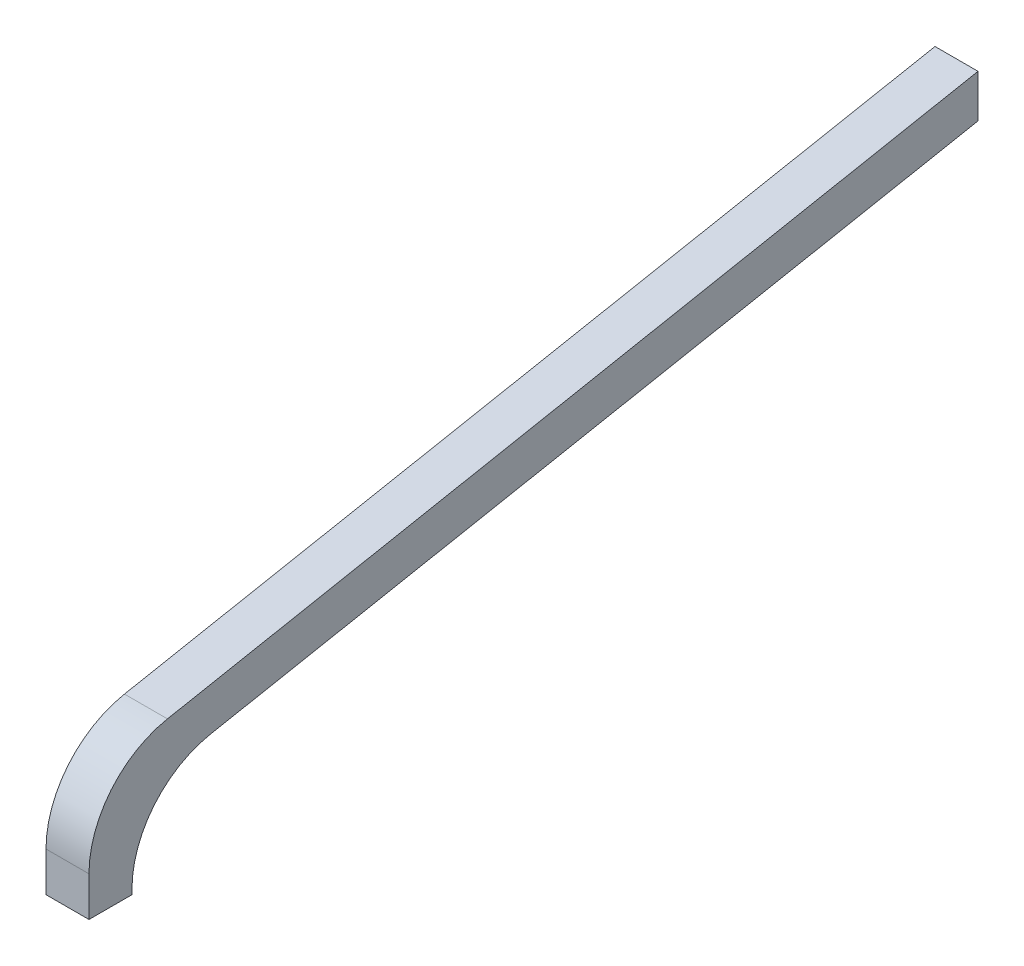
ISO-10303-21;
HEADER;
FILE_DESCRIPTION(('STEP AP214'),'2;1');
FILE_NAME('part.step','',(''),(''),'','','');
FILE_SCHEMA(('AUTOMOTIVE_DESIGN { 1 0 10303 214 1 1 1 1 }'));
ENDSEC;
DATA;
#1=APPLICATION_CONTEXT('core data for automotive mechanical design processes');
#2=APPLICATION_PROTOCOL_DEFINITION('international standard','automotive_design',2000,#1);
#3=PRODUCT_CONTEXT('',#1,'mechanical');
#4=PRODUCT('Part','Part','',(#3));
#5=PRODUCT_RELATED_PRODUCT_CATEGORY('part','',(#4));
#6=PRODUCT_DEFINITION_FORMATION('','',#4);
#7=PRODUCT_DEFINITION_CONTEXT('part definition',#1,'design');
#8=PRODUCT_DEFINITION('design','',#6,#7);
#9=PRODUCT_DEFINITION_SHAPE('','',#8);
#10=(LENGTH_UNIT() NAMED_UNIT(*) SI_UNIT(.MILLI.,.METRE.));
#11=(NAMED_UNIT(*) PLANE_ANGLE_UNIT() SI_UNIT($,.RADIAN.));
#12=(NAMED_UNIT(*) SI_UNIT($,.STERADIAN.) SOLID_ANGLE_UNIT());
#13=UNCERTAINTY_MEASURE_WITH_UNIT(LENGTH_MEASURE(1.E-05),#10,'distance_accuracy_value','');
#14=(GEOMETRIC_REPRESENTATION_CONTEXT(3) GLOBAL_UNCERTAINTY_ASSIGNED_CONTEXT((#13)) GLOBAL_UNIT_ASSIGNED_CONTEXT((#10,
#11,#12)) REPRESENTATION_CONTEXT('',''));
#15=CARTESIAN_POINT('',(0.,0.,0.));
#16=DIRECTION('',(0.,0.,1.));
#17=DIRECTION('',(1.,0.,0.));
#18=AXIS2_PLACEMENT_3D('',#15,#16,#17);
#19=CARTESIAN_POINT('',(0.28575,-3.01580115473571,-2.8055));
#20=DIRECTION('',(1.,0.,0.));
#21=DIRECTION('',(0.,0.,-1.));
#22=AXIS2_PLACEMENT_3D('',#19,#20,#21);
#23=PLANE('',#22);
#24=DIRECTION('',(0.,-0.18846469104419,0.982079966311104));
#25=VECTOR('',#24,1.);
#26=CARTESIAN_POINT('',(0.28575,-2.3929200336889,-3.06153530895581));
#27=LINE('',#26,#25);
#28=CARTESIAN_POINT('',(0.28575,-0.869500000000001,-11.));
#29=VERTEX_POINT('',#28);
#30=CARTESIAN_POINT('',(0.28575,-2.3929200336889,-3.06153530895581));
#31=VERTEX_POINT('',#30);
#32=EDGE_CURVE('E96',#29,#31,#27,.T.);
#33=ORIENTED_EDGE('',*,*,#32,.T.);
#34=CARTESIAN_POINT('',(0.28575,-3.375,-3.25));
#35=DIRECTION('',(-1.,0.,0.));
#36=DIRECTION('',(0.,0.,1.));
#37=AXIS2_PLACEMENT_3D('',#34,#35,#36);
#38=CIRCLE('',#37,1.);
#39=CARTESIAN_POINT('',(0.28575,-3.375,-2.25));
#40=VERTEX_POINT('',#39);
#41=EDGE_CURVE('E119',#31,#40,#38,.F.);
#42=ORIENTED_EDGE('',*,*,#41,.T.);
#43=DIRECTION('',(0.,1.,0.));
#44=VECTOR('',#43,1.);
#45=CARTESIAN_POINT('',(0.28575,-3.425,-2.25));
#46=LINE('',#45,#44);
#47=CARTESIAN_POINT('',(0.28575,-3.425,-2.25));
#48=VERTEX_POINT('',#47);
#49=EDGE_CURVE('E124',#40,#48,#46,.F.);
#50=ORIENTED_EDGE('',*,*,#49,.T.);
#51=DIRECTION('',(0.,0.,1.));
#52=VECTOR('',#51,1.);
#53=CARTESIAN_POINT('',(0.28575,-3.425,-1.8055));
#54=LINE('',#53,#52);
#55=CARTESIAN_POINT('',(0.28575,-3.425,-1.8055));
#56=VERTEX_POINT('',#55);
#57=EDGE_CURVE('E133',#48,#56,#54,.T.);
#58=ORIENTED_EDGE('',*,*,#57,.T.);
#59=DIRECTION('',(0.,1.,0.));
#60=VECTOR('',#59,1.);
#61=CARTESIAN_POINT('',(0.28575,-3.01580115473571,-1.8055));
#62=LINE('',#61,#60);
#63=CARTESIAN_POINT('',(0.28575,-3.01580115473571,-1.8055));
#64=VERTEX_POINT('',#63);
#65=EDGE_CURVE('E141',#56,#64,#62,.T.);
#66=ORIENTED_EDGE('',*,*,#65,.T.);
#67=CARTESIAN_POINT('',(0.28575,-3.01580115473571,-2.8055));
#68=DIRECTION('',(-1.,0.,0.));
#69=DIRECTION('',(0.,0.,1.));
#70=AXIS2_PLACEMENT_3D('',#67,#68,#69);
#71=CIRCLE('',#70,1.);
#72=CARTESIAN_POINT('',(0.28575,-2.03372118842461,-2.61703530895581));
#73=VERTEX_POINT('',#72);
#74=EDGE_CURVE('E20',#73,#64,#71,.F.);
#75=ORIENTED_EDGE('',*,*,#74,.F.);
#76=DIRECTION('',(0.,0.18846469104419,-0.982079966311104));
#77=VECTOR('',#76,1.);
#78=CARTESIAN_POINT('',(0.28575,-0.425000000000001,-11.));
#79=LINE('',#78,#77);
#80=CARTESIAN_POINT('',(0.28575,-0.425000000000001,-11.));
#81=VERTEX_POINT('',#80);
#82=EDGE_CURVE('E150',#73,#81,#79,.T.);
#83=ORIENTED_EDGE('',*,*,#82,.T.);
#84=DIRECTION('',(0.,1.,0.));
#85=VECTOR('',#84,1.);
#86=CARTESIAN_POINT('',(0.28575,-0.869500000000001,-11.));
#87=LINE('',#86,#85);
#88=EDGE_CURVE('E70',#81,#29,#87,.F.);
#89=ORIENTED_EDGE('',*,*,#88,.T.);
#90=EDGE_LOOP('',(#33,#42,#50,#58,#66,#75,#83,#89));
#91=FACE_BOUND('',#90,.T.);
#92=ADVANCED_FACE('F17',(#91),#23,.F.);
#93=CARTESIAN_POINT('',(0.73025,-0.869500000000001,-11.));
#94=DIRECTION('',(0.,0.,1.));
#95=DIRECTION('',(1.,0.,0.));
#96=AXIS2_PLACEMENT_3D('',#93,#94,#95);
#97=PLANE('',#96);
#98=DIRECTION('',(1.,0.,0.));
#99=VECTOR('',#98,1.);
#100=CARTESIAN_POINT('',(0.73025,-0.425000000000001,-11.));
#101=LINE('',#100,#99);
#102=CARTESIAN_POINT('',(0.73025,-0.425000000000001,-11.));
#103=VERTEX_POINT('',#102);
#104=EDGE_CURVE('E91',#81,#103,#101,.T.);
#105=ORIENTED_EDGE('',*,*,#104,.T.);
#106=DIRECTION('',(0.,1.,0.));
#107=VECTOR('',#106,1.);
#108=CARTESIAN_POINT('',(0.73025,-3.01580115473571,-11.));
#109=LINE('',#108,#107);
#110=CARTESIAN_POINT('',(0.73025,-0.869500000000001,-11.));
#111=VERTEX_POINT('',#110);
#112=EDGE_CURVE('E85',#111,#103,#109,.T.);
#113=ORIENTED_EDGE('',*,*,#112,.F.);
#114=DIRECTION('',(1.,0.,0.));
#115=VECTOR('',#114,1.);
#116=CARTESIAN_POINT('',(0.73025,-0.869500000000001,-11.));
#117=LINE('',#116,#115);
#118=EDGE_CURVE('E88',#111,#29,#117,.F.);
#119=ORIENTED_EDGE('',*,*,#118,.T.);
#120=ORIENTED_EDGE('',*,*,#88,.F.);
#121=EDGE_LOOP('',(#105,#113,#119,#120));
#122=FACE_BOUND('',#121,.T.);
#123=ADVANCED_FACE('F87',(#122),#97,.F.);
#124=CARTESIAN_POINT('',(0.73025,-0.425000000000001,-11.));
#125=DIRECTION('',(0.,-0.982079966311104,-0.18846469104419));
#126=DIRECTION('',(0.,0.18846469104419,-0.982079966311104));
#127=AXIS2_PLACEMENT_3D('',#124,#125,#126);
#128=PLANE('',#127);
#129=DIRECTION('',(-1.,0.,0.));
#130=VECTOR('',#129,1.);
#131=CARTESIAN_POINT('',(0.73025,-2.03372118842461,-2.61703530895581));
#132=LINE('',#131,#130);
#133=CARTESIAN_POINT('',(0.73025,-2.03372118842461,-2.61703530895581));
#134=VERTEX_POINT('',#133);
#135=EDGE_CURVE('E146',#134,#73,#132,.T.);
#136=ORIENTED_EDGE('',*,*,#135,.F.);
#137=DIRECTION('',(0.,-0.18846469104419,0.982079966311103));
#138=VECTOR('',#137,1.);
#139=CARTESIAN_POINT('',(0.73025,-0.425000000000001,-11.));
#140=LINE('',#139,#138);
#141=EDGE_CURVE('E95',#103,#134,#140,.T.);
#142=ORIENTED_EDGE('',*,*,#141,.F.);
#143=ORIENTED_EDGE('',*,*,#104,.F.);
#144=ORIENTED_EDGE('',*,*,#82,.F.);
#145=EDGE_LOOP('',(#136,#142,#143,#144));
#146=FACE_BOUND('',#145,.T.);
#147=ADVANCED_FACE('F190',(#146),#128,.F.);
#148=CARTESIAN_POINT('',(0.73025,-3.01580115473571,-2.8055));
#149=DIRECTION('',(-1.,0.,0.));
#150=DIRECTION('',(0.,0.,1.));
#151=AXIS2_PLACEMENT_3D('',#148,#149,#150);
#152=CYLINDRICAL_SURFACE('',#151,1.);
#153=CARTESIAN_POINT('',(0.73025,-3.01580115473571,-2.8055));
#154=DIRECTION('',(-1.,0.,0.));
#155=DIRECTION('',(0.,0.,1.));
#156=AXIS2_PLACEMENT_3D('',#153,#154,#155);
#157=CIRCLE('',#156,1.);
#158=CARTESIAN_POINT('',(0.73025,-3.01580115473571,-1.8055));
#159=VERTEX_POINT('',#158);
#160=EDGE_CURVE('E116',#134,#159,#157,.F.);
#161=ORIENTED_EDGE('',*,*,#160,.F.);
#162=ORIENTED_EDGE('',*,*,#135,.T.);
#163=ORIENTED_EDGE('',*,*,#74,.T.);
#164=DIRECTION('',(-1.,0.,0.));
#165=VECTOR('',#164,1.);
#166=CARTESIAN_POINT('',(0.73025,-3.01580115473571,-1.8055));
#167=LINE('',#166,#165);
#168=EDGE_CURVE('E144',#64,#159,#167,.F.);
#169=ORIENTED_EDGE('',*,*,#168,.T.);
#170=EDGE_LOOP('',(#161,#162,#163,#169));
#171=FACE_BOUND('',#170,.T.);
#172=ADVANCED_FACE('F169',(#171),#152,.T.);
#173=CARTESIAN_POINT('',(0.73025,-3.01580115473571,-1.8055));
#174=DIRECTION('',(0.,0.,-1.));
#175=DIRECTION('',(-1.,0.,0.));
#176=AXIS2_PLACEMENT_3D('',#173,#174,#175);
#177=PLANE('',#176);
#178=DIRECTION('',(1.,0.,0.));
#179=VECTOR('',#178,1.);
#180=CARTESIAN_POINT('',(0.73025,-3.425,-1.8055));
#181=LINE('',#180,#179);
#182=CARTESIAN_POINT('',(0.73025,-3.425,-1.8055));
#183=VERTEX_POINT('',#182);
#184=EDGE_CURVE('E139',#56,#183,#181,.T.);
#185=ORIENTED_EDGE('',*,*,#184,.T.);
#186=DIRECTION('',(0.,1.,0.));
#187=VECTOR('',#186,1.);
#188=CARTESIAN_POINT('',(0.73025,-3.01580115473571,-1.8055));
#189=LINE('',#188,#187);
#190=EDGE_CURVE('E118',#159,#183,#189,.F.);
#191=ORIENTED_EDGE('',*,*,#190,.F.);
#192=ORIENTED_EDGE('',*,*,#168,.F.);
#193=ORIENTED_EDGE('',*,*,#65,.F.);
#194=EDGE_LOOP('',(#185,#191,#192,#193));
#195=FACE_BOUND('',#194,.T.);
#196=ADVANCED_FACE('F174',(#195),#177,.F.);
#197=CARTESIAN_POINT('',(0.73025,-3.425,-1.8055));
#198=DIRECTION('',(0.,1.,0.));
#199=DIRECTION('',(0.,0.,1.));
#200=AXIS2_PLACEMENT_3D('',#197,#198,#199);
#201=PLANE('',#200);
#202=DIRECTION('',(1.,0.,0.));
#203=VECTOR('',#202,1.);
#204=CARTESIAN_POINT('',(0.73025,-3.425,-2.25));
#205=LINE('',#204,#203);
#206=CARTESIAN_POINT('',(0.73025,-3.425,-2.25));
#207=VERTEX_POINT('',#206);
#208=EDGE_CURVE('E127',#48,#207,#205,.T.);
#209=ORIENTED_EDGE('',*,*,#208,.T.);
#210=DIRECTION('',(0.,0.,-1.));
#211=VECTOR('',#210,1.);
#212=CARTESIAN_POINT('',(0.73025,-3.425,-2.8055));
#213=LINE('',#212,#211);
#214=EDGE_CURVE('E110',#183,#207,#213,.T.);
#215=ORIENTED_EDGE('',*,*,#214,.F.);
#216=ORIENTED_EDGE('',*,*,#184,.F.);
#217=ORIENTED_EDGE('',*,*,#57,.F.);
#218=EDGE_LOOP('',(#209,#215,#216,#217));
#219=FACE_BOUND('',#218,.T.);
#220=ADVANCED_FACE('F212',(#219),#201,.F.);
#221=CARTESIAN_POINT('',(0.73025,-3.425,-2.25));
#222=DIRECTION('',(0.,0.,1.));
#223=DIRECTION('',(1.,0.,0.));
#224=AXIS2_PLACEMENT_3D('',#221,#222,#223);
#225=PLANE('',#224);
#226=DIRECTION('',(-1.,0.,0.));
#227=VECTOR('',#226,1.);
#228=CARTESIAN_POINT('',(0.73025,-3.375,-2.25));
#229=LINE('',#228,#227);
#230=CARTESIAN_POINT('',(0.73025,-3.375,-2.25));
#231=VERTEX_POINT('',#230);
#232=EDGE_CURVE('E121',#40,#231,#229,.F.);
#233=ORIENTED_EDGE('',*,*,#232,.T.);
#234=DIRECTION('',(0.,1.,0.));
#235=VECTOR('',#234,1.);
#236=CARTESIAN_POINT('',(0.73025,-3.01580115473571,-2.25));
#237=LINE('',#236,#235);
#238=EDGE_CURVE('E107',#207,#231,#237,.T.);
#239=ORIENTED_EDGE('',*,*,#238,.F.);
#240=ORIENTED_EDGE('',*,*,#208,.F.);
#241=ORIENTED_EDGE('',*,*,#49,.F.);
#242=EDGE_LOOP('',(#233,#239,#240,#241));
#243=FACE_BOUND('',#242,.T.);
#244=ADVANCED_FACE('F209',(#243),#225,.F.);
#245=CARTESIAN_POINT('',(0.73025,-3.375,-3.25));
#246=DIRECTION('',(-1.,0.,0.));
#247=DIRECTION('',(0.,0.,1.));
#248=AXIS2_PLACEMENT_3D('',#245,#246,#247);
#249=CYLINDRICAL_SURFACE('',#248,1.);
#250=DIRECTION('',(1.,0.,0.));
#251=VECTOR('',#250,1.);
#252=CARTESIAN_POINT('',(0.73025,-2.3929200336889,-3.06153530895581));
#253=LINE('',#252,#251);
#254=CARTESIAN_POINT('',(0.73025,-2.3929200336889,-3.06153530895581));
#255=VERTEX_POINT('',#254);
#256=EDGE_CURVE('E35',#31,#255,#253,.T.);
#257=ORIENTED_EDGE('',*,*,#256,.T.);
#258=CARTESIAN_POINT('',(0.73025,-3.375,-3.25));
#259=DIRECTION('',(-1.,0.,0.));
#260=DIRECTION('',(0.,0.,1.));
#261=AXIS2_PLACEMENT_3D('',#258,#259,#260);
#262=CIRCLE('',#261,1.);
#263=EDGE_CURVE('E26',#231,#255,#262,.T.);
#264=ORIENTED_EDGE('',*,*,#263,.F.);
#265=ORIENTED_EDGE('',*,*,#232,.F.);
#266=ORIENTED_EDGE('',*,*,#41,.F.);
#267=EDGE_LOOP('',(#257,#264,#265,#266));
#268=FACE_BOUND('',#267,.T.);
#269=ADVANCED_FACE('F204',(#268),#249,.F.);
#270=CARTESIAN_POINT('',(0.73025,-2.3929200336889,-3.06153530895581));
#271=DIRECTION('',(0.,0.982079966311104,0.18846469104419));
#272=DIRECTION('',(0.,-0.18846469104419,0.982079966311104));
#273=AXIS2_PLACEMENT_3D('',#270,#271,#272);
#274=PLANE('',#273);
#275=ORIENTED_EDGE('',*,*,#118,.F.);
#276=DIRECTION('',(0.,0.18846469104419,-0.982079966311103));
#277=VECTOR('',#276,1.);
#278=CARTESIAN_POINT('',(0.73025,-2.3929200336889,-3.06153530895581));
#279=LINE('',#278,#277);
#280=EDGE_CURVE('E11',#255,#111,#279,.T.);
#281=ORIENTED_EDGE('',*,*,#280,.F.);
#282=ORIENTED_EDGE('',*,*,#256,.F.);
#283=ORIENTED_EDGE('',*,*,#32,.F.);
#284=EDGE_LOOP('',(#275,#281,#282,#283));
#285=FACE_BOUND('',#284,.T.);
#286=ADVANCED_FACE('F99',(#285),#274,.F.);
#287=CARTESIAN_POINT('',(0.73025,-3.01580115473571,-2.8055));
#288=DIRECTION('',(1.,0.,0.));
#289=DIRECTION('',(0.,0.,-1.));
#290=AXIS2_PLACEMENT_3D('',#287,#288,#289);
#291=PLANE('',#290);
#292=ORIENTED_EDGE('',*,*,#263,.T.);
#293=ORIENTED_EDGE('',*,*,#280,.T.);
#294=ORIENTED_EDGE('',*,*,#112,.T.);
#295=ORIENTED_EDGE('',*,*,#141,.T.);
#296=ORIENTED_EDGE('',*,*,#160,.T.);
#297=ORIENTED_EDGE('',*,*,#190,.T.);
#298=ORIENTED_EDGE('',*,*,#214,.T.);
#299=ORIENTED_EDGE('',*,*,#238,.T.);
#300=EDGE_LOOP('',(#292,#293,#294,#295,#296,#297,#298,#299));
#301=FACE_BOUND('',#300,.T.);
#302=ADVANCED_FACE('F103',(#301),#291,.T.);
#303=CLOSED_SHELL('',(#92,#123,#147,#172,#196,#220,#244,#269,#286,#302));
#304=MANIFOLD_SOLID_BREP('B1',#303);
#305=ADVANCED_BREP_SHAPE_REPRESENTATION('',(#18,#304),#14);
#306=SHAPE_DEFINITION_REPRESENTATION(#9,#305);
ENDSEC;
END-ISO-10303-21;
